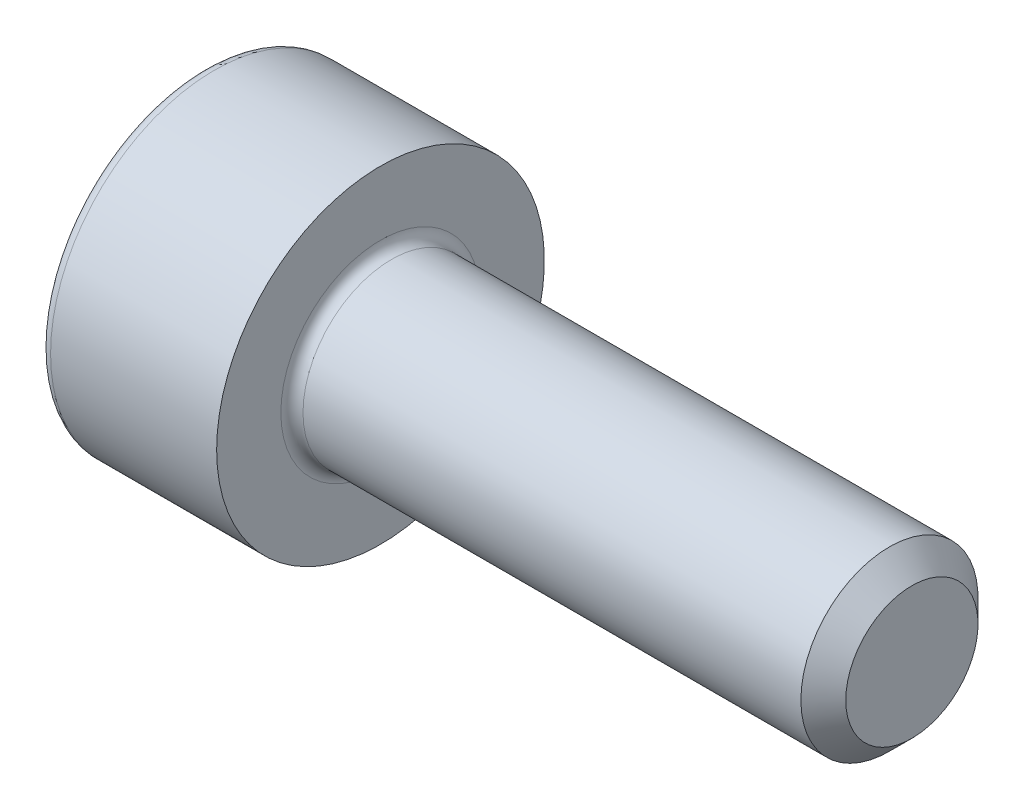
ISO-10303-21;
HEADER;
FILE_DESCRIPTION(('STEP AP214'),'2;1');
FILE_NAME('part.step','',(''),(''),'','','');
FILE_SCHEMA(('AUTOMOTIVE_DESIGN { 1 0 10303 214 1 1 1 1 }'));
ENDSEC;
DATA;
#1=APPLICATION_CONTEXT('core data for automotive mechanical design processes');
#2=APPLICATION_PROTOCOL_DEFINITION('international standard','automotive_design',2000,#1);
#3=PRODUCT_CONTEXT('',#1,'mechanical');
#4=PRODUCT('Part','Part','',(#3));
#5=PRODUCT_RELATED_PRODUCT_CATEGORY('part','',(#4));
#6=PRODUCT_DEFINITION_FORMATION('','',#4);
#7=PRODUCT_DEFINITION_CONTEXT('part definition',#1,'design');
#8=PRODUCT_DEFINITION('design','',#6,#7);
#9=PRODUCT_DEFINITION_SHAPE('','',#8);
#10=(LENGTH_UNIT() NAMED_UNIT(*) SI_UNIT(.MILLI.,.METRE.));
#11=(NAMED_UNIT(*) PLANE_ANGLE_UNIT() SI_UNIT($,.RADIAN.));
#12=(NAMED_UNIT(*) SI_UNIT($,.STERADIAN.) SOLID_ANGLE_UNIT());
#13=UNCERTAINTY_MEASURE_WITH_UNIT(LENGTH_MEASURE(1.E-05),#10,'distance_accuracy_value','');
#14=(GEOMETRIC_REPRESENTATION_CONTEXT(3) GLOBAL_UNCERTAINTY_ASSIGNED_CONTEXT((#13)) GLOBAL_UNIT_ASSIGNED_CONTEXT((#10,
#11,#12)) REPRESENTATION_CONTEXT('',''));
#15=CARTESIAN_POINT('',(0.,0.,0.));
#16=DIRECTION('',(0.,0.,1.));
#17=DIRECTION('',(1.,0.,0.));
#18=AXIS2_PLACEMENT_3D('',#15,#16,#17);
#19=CARTESIAN_POINT('',(6.,0.,0.));
#20=DIRECTION('',(-1.,0.,0.));
#21=DIRECTION('',(0.,0.,1.));
#22=AXIS2_PLACEMENT_3D('',#19,#20,#21);
#23=CONICAL_SURFACE('',#22,0.746499999993503,0.785398163397448);
#24=CARTESIAN_POINT('',(5.7464999999935,0.,0.));
#25=DIRECTION('',(-1.,0.,0.));
#26=DIRECTION('',(0.,0.,1.));
#27=AXIS2_PLACEMENT_3D('',#24,#25,#26);
#28=CIRCLE('',#27,1.);
#29=CARTESIAN_POINT('',(5.7464999999935,0.,1.));
#30=VERTEX_POINT('',#29);
#31=EDGE_CURVE('E11',#30,#30,#28,.T.);
#32=ORIENTED_EDGE('',*,*,#31,.F.);
#33=EDGE_LOOP('',(#32));
#34=FACE_BOUND('',#33,.T.);
#35=CARTESIAN_POINT('',(6.,0.,0.));
#36=DIRECTION('',(-1.,0.,0.));
#37=DIRECTION('',(0.,0.,1.));
#38=AXIS2_PLACEMENT_3D('',#35,#36,#37);
#39=CIRCLE('',#38,0.746499999993503);
#40=CARTESIAN_POINT('',(6.,0.,0.746499999993503));
#41=VERTEX_POINT('',#40);
#42=EDGE_CURVE('E133',#41,#41,#39,.T.);
#43=ORIENTED_EDGE('',*,*,#42,.T.);
#44=EDGE_LOOP('',(#43));
#45=FACE_BOUND('',#44,.T.);
#46=ADVANCED_FACE('F32',(#34,#45),#23,.T.);
#47=CARTESIAN_POINT('',(-2.,0.,0.));
#48=DIRECTION('',(-1.,0.,0.));
#49=DIRECTION('',(0.,0.,1.));
#50=AXIS2_PLACEMENT_3D('',#47,#48,#49);
#51=CYLINDRICAL_SURFACE('',#50,1.);
#52=CARTESIAN_POINT('',(0.125,0.,0.));
#53=DIRECTION('',(-1.,0.,0.));
#54=DIRECTION('',(0.,0.,1.));
#55=AXIS2_PLACEMENT_3D('',#52,#53,#54);
#56=CIRCLE('',#55,1.);
#57=CARTESIAN_POINT('',(0.125,0.,1.));
#58=VERTEX_POINT('',#57);
#59=EDGE_CURVE('E39',#58,#58,#56,.T.);
#60=ORIENTED_EDGE('',*,*,#59,.F.);
#61=EDGE_LOOP('',(#60));
#62=FACE_BOUND('',#61,.T.);
#63=ORIENTED_EDGE('',*,*,#31,.T.);
#64=EDGE_LOOP('',(#63));
#65=FACE_BOUND('',#64,.T.);
#66=ADVANCED_FACE('F157',(#62,#65),#51,.T.);
#67=CARTESIAN_POINT('',(0.125,0.,0.));
#68=DIRECTION('',(-1.,0.,0.));
#69=DIRECTION('',(0.,0.,1.));
#70=AXIS2_PLACEMENT_3D('',#67,#68,#69);
#71=TOROIDAL_SURFACE('',#70,1.125,0.125);
#72=CARTESIAN_POINT('',(0.,0.,0.));
#73=DIRECTION('',(-1.,0.,0.));
#74=DIRECTION('',(0.,0.,1.));
#75=AXIS2_PLACEMENT_3D('',#72,#73,#74);
#76=CIRCLE('',#75,1.125);
#77=CARTESIAN_POINT('',(0.,0.,1.125));
#78=VERTEX_POINT('',#77);
#79=EDGE_CURVE('E150',#78,#78,#76,.T.);
#80=ORIENTED_EDGE('',*,*,#79,.F.);
#81=EDGE_LOOP('',(#80));
#82=FACE_BOUND('',#81,.T.);
#83=ORIENTED_EDGE('',*,*,#59,.T.);
#84=EDGE_LOOP('',(#83));
#85=FACE_BOUND('',#84,.T.);
#86=ADVANCED_FACE('F155',(#82,#85),#71,.F.);
#87=CARTESIAN_POINT('',(0.,1.125,0.));
#88=DIRECTION('',(-1.,0.,0.));
#89=DIRECTION('',(0.,0.,1.));
#90=AXIS2_PLACEMENT_3D('',#87,#88,#89);
#91=PLANE('',#90);
#92=CARTESIAN_POINT('',(0.,0.,0.));
#93=DIRECTION('',(-1.,0.,0.));
#94=DIRECTION('',(0.,0.,1.));
#95=AXIS2_PLACEMENT_3D('',#92,#93,#94);
#96=CIRCLE('',#95,1.85);
#97=CARTESIAN_POINT('',(0.,0.,1.85));
#98=VERTEX_POINT('',#97);
#99=EDGE_CURVE('E147',#98,#98,#96,.T.);
#100=ORIENTED_EDGE('',*,*,#99,.F.);
#101=EDGE_LOOP('',(#100));
#102=FACE_BOUND('',#101,.T.);
#103=ORIENTED_EDGE('',*,*,#79,.T.);
#104=EDGE_LOOP('',(#103));
#105=FACE_BOUND('',#104,.T.);
#106=ADVANCED_FACE('F188',(#102,#105),#91,.F.);
#107=CARTESIAN_POINT('',(-2.,0.,0.));
#108=DIRECTION('',(-1.,0.,0.));
#109=DIRECTION('',(0.,0.,1.));
#110=AXIS2_PLACEMENT_3D('',#107,#108,#109);
#111=CYLINDRICAL_SURFACE('',#110,1.85);
#112=CARTESIAN_POINT('',(-1.875,0.,0.));
#113=DIRECTION('',(-1.,0.,0.));
#114=DIRECTION('',(0.,0.,1.));
#115=AXIS2_PLACEMENT_3D('',#112,#113,#114);
#116=CIRCLE('',#115,1.85);
#117=CARTESIAN_POINT('',(-1.875,0.,1.85));
#118=VERTEX_POINT('',#117);
#119=EDGE_CURVE('E144',#118,#118,#116,.T.);
#120=ORIENTED_EDGE('',*,*,#119,.F.);
#121=EDGE_LOOP('',(#120));
#122=FACE_BOUND('',#121,.T.);
#123=ORIENTED_EDGE('',*,*,#99,.T.);
#124=EDGE_LOOP('',(#123));
#125=FACE_BOUND('',#124,.T.);
#126=ADVANCED_FACE('F184',(#122,#125),#111,.T.);
#127=CARTESIAN_POINT('',(-1.875,0.,0.));
#128=DIRECTION('',(-1.,0.,0.));
#129=DIRECTION('',(0.,0.,1.));
#130=AXIS2_PLACEMENT_3D('',#127,#128,#129);
#131=TOROIDAL_SURFACE('',#130,1.725,0.125);
#132=CARTESIAN_POINT('',(-2.,0.,0.));
#133=DIRECTION('',(-1.,0.,0.));
#134=DIRECTION('',(0.,0.,1.));
#135=AXIS2_PLACEMENT_3D('',#132,#133,#134);
#136=CIRCLE('',#135,1.725);
#137=CARTESIAN_POINT('',(-2.,0.,1.725));
#138=VERTEX_POINT('',#137);
#139=EDGE_CURVE('E141',#138,#138,#136,.T.);
#140=ORIENTED_EDGE('',*,*,#139,.F.);
#141=EDGE_LOOP('',(#140));
#142=FACE_BOUND('',#141,.T.);
#143=ORIENTED_EDGE('',*,*,#119,.T.);
#144=EDGE_LOOP('',(#143));
#145=FACE_BOUND('',#144,.T.);
#146=ADVANCED_FACE('F177',(#142,#145),#131,.T.);
#147=CARTESIAN_POINT('',(-2.,1.725,0.));
#148=DIRECTION('',(1.,0.,0.));
#149=DIRECTION('',(0.,0.,-1.));
#150=AXIS2_PLACEMENT_3D('',#147,#148,#149);
#151=PLANE('',#150);
#152=DIRECTION('',(0.,0.5,-0.866025403784438));
#153=VECTOR('',#152,1.);
#154=CARTESIAN_POINT('',(-2.,0.433012701892219,0.75));
#155=LINE('',#154,#153);
#156=CARTESIAN_POINT('',(-2.,0.433012701892219,0.75));
#157=VERTEX_POINT('',#156);
#158=CARTESIAN_POINT('',(-2.,0.866025403784439,0.));
#159=VERTEX_POINT('',#158);
#160=EDGE_CURVE('E120',#157,#159,#155,.T.);
#161=ORIENTED_EDGE('',*,*,#160,.F.);
#162=DIRECTION('',(0.,1.,0.));
#163=VECTOR('',#162,1.);
#164=CARTESIAN_POINT('',(-2.,-0.43301270189222,0.75));
#165=LINE('',#164,#163);
#166=CARTESIAN_POINT('',(-2.,-0.43301270189222,0.75));
#167=VERTEX_POINT('',#166);
#168=EDGE_CURVE('E46',#167,#157,#165,.T.);
#169=ORIENTED_EDGE('',*,*,#168,.F.);
#170=DIRECTION('',(0.,0.5,0.866025403784439));
#171=VECTOR('',#170,1.);
#172=CARTESIAN_POINT('',(-2.,-0.866025403784439,0.));
#173=LINE('',#172,#171);
#174=CARTESIAN_POINT('',(-2.,-0.866025403784439,0.));
#175=VERTEX_POINT('',#174);
#176=EDGE_CURVE('E129',#175,#167,#173,.T.);
#177=ORIENTED_EDGE('',*,*,#176,.F.);
#178=DIRECTION('',(0.,-0.5,0.866025403784439));
#179=VECTOR('',#178,1.);
#180=CARTESIAN_POINT('',(-2.,-0.433012701892219,-0.75));
#181=LINE('',#180,#179);
#182=CARTESIAN_POINT('',(-2.,-0.433012701892219,-0.75));
#183=VERTEX_POINT('',#182);
#184=EDGE_CURVE('E127',#183,#175,#181,.T.);
#185=ORIENTED_EDGE('',*,*,#184,.F.);
#186=DIRECTION('',(0.,-1.,0.));
#187=VECTOR('',#186,1.);
#188=CARTESIAN_POINT('',(-2.,0.43301270189222,-0.75));
#189=LINE('',#188,#187);
#190=CARTESIAN_POINT('',(-2.,0.43301270189222,-0.75));
#191=VERTEX_POINT('',#190);
#192=EDGE_CURVE('E94',#191,#183,#189,.T.);
#193=ORIENTED_EDGE('',*,*,#192,.F.);
#194=DIRECTION('',(0.,-0.5,-0.866025403784439));
#195=VECTOR('',#194,1.);
#196=CARTESIAN_POINT('',(-2.,0.866025403784439,0.));
#197=LINE('',#196,#195);
#198=EDGE_CURVE('E123',#159,#191,#197,.T.);
#199=ORIENTED_EDGE('',*,*,#198,.F.);
#200=EDGE_LOOP('',(#161,#169,#177,#185,#193,#199));
#201=FACE_BOUND('',#200,.T.);
#202=ORIENTED_EDGE('',*,*,#139,.T.);
#203=EDGE_LOOP('',(#202));
#204=FACE_BOUND('',#203,.T.);
#205=ADVANCED_FACE('F169',(#201,#204),#151,.F.);
#206=CARTESIAN_POINT('',(6.,0.746499999993503,0.));
#207=DIRECTION('',(-1.,0.,0.));
#208=DIRECTION('',(0.,0.,1.));
#209=AXIS2_PLACEMENT_3D('',#206,#207,#208);
#210=PLANE('',#209);
#211=ORIENTED_EDGE('',*,*,#42,.F.);
#212=EDGE_LOOP('',(#211));
#213=FACE_BOUND('',#212,.T.);
#214=ADVANCED_FACE('F166',(#213),#210,.F.);
#215=CARTESIAN_POINT('',(-0.9,-0.43301270189222,0.75));
#216=DIRECTION('',(0.,0.,1.));
#217=DIRECTION('',(1.,0.,0.));
#218=AXIS2_PLACEMENT_3D('',#215,#216,#217);
#219=PLANE('',#218);
#220=ORIENTED_EDGE('',*,*,#168,.T.);
#221=DIRECTION('',(-1.,0.,0.));
#222=VECTOR('',#221,1.);
#223=CARTESIAN_POINT('',(-0.9,0.433012701892219,0.75));
#224=LINE('',#223,#222);
#225=CARTESIAN_POINT('',(-0.9,0.433012701892219,0.75));
#226=VERTEX_POINT('',#225);
#227=EDGE_CURVE('E76',#226,#157,#224,.T.);
#228=ORIENTED_EDGE('',*,*,#227,.F.);
#229=DIRECTION('',(0.,1.,0.));
#230=VECTOR('',#229,1.);
#231=CARTESIAN_POINT('',(-0.9,-0.43301270189222,0.75));
#232=LINE('',#231,#230);
#233=CARTESIAN_POINT('',(-0.9,-0.43301270189222,0.75));
#234=VERTEX_POINT('',#233);
#235=EDGE_CURVE('E131',#234,#226,#232,.T.);
#236=ORIENTED_EDGE('',*,*,#235,.F.);
#237=DIRECTION('',(-1.,0.,0.));
#238=VECTOR('',#237,1.);
#239=CARTESIAN_POINT('',(-0.9,-0.43301270189222,0.75));
#240=LINE('',#239,#238);
#241=EDGE_CURVE('E54',#234,#167,#240,.T.);
#242=ORIENTED_EDGE('',*,*,#241,.T.);
#243=EDGE_LOOP('',(#220,#228,#236,#242));
#244=FACE_BOUND('',#243,.T.);
#245=ADVANCED_FACE('F168',(#244),#219,.F.);
#246=CARTESIAN_POINT('',(-0.9,-0.866025403784439,0.));
#247=DIRECTION('',(0.,-0.866025403784439,0.5));
#248=DIRECTION('',(0.,-0.5,-0.866025403784439));
#249=AXIS2_PLACEMENT_3D('',#246,#247,#248);
#250=PLANE('',#249);
#251=ORIENTED_EDGE('',*,*,#176,.T.);
#252=ORIENTED_EDGE('',*,*,#241,.F.);
#253=DIRECTION('',(0.,0.5,0.866025403784439));
#254=VECTOR('',#253,1.);
#255=CARTESIAN_POINT('',(-0.9,-0.866025403784439,0.));
#256=LINE('',#255,#254);
#257=CARTESIAN_POINT('',(-0.9,-0.866025403784439,0.));
#258=VERTEX_POINT('',#257);
#259=EDGE_CURVE('E106',#258,#234,#256,.T.);
#260=ORIENTED_EDGE('',*,*,#259,.F.);
#261=DIRECTION('',(-1.,0.,0.));
#262=VECTOR('',#261,1.);
#263=CARTESIAN_POINT('',(-0.9,-0.866025403784439,0.));
#264=LINE('',#263,#262);
#265=EDGE_CURVE('E98',#258,#175,#264,.T.);
#266=ORIENTED_EDGE('',*,*,#265,.T.);
#267=EDGE_LOOP('',(#251,#252,#260,#266));
#268=FACE_BOUND('',#267,.T.);
#269=ADVANCED_FACE('F175',(#268),#250,.F.);
#270=CARTESIAN_POINT('',(-0.9,-0.433012701892219,-0.75));
#271=DIRECTION('',(0.,-0.866025403784439,-0.5));
#272=DIRECTION('',(0.,0.5,-0.866025403784439));
#273=AXIS2_PLACEMENT_3D('',#270,#271,#272);
#274=PLANE('',#273);
#275=ORIENTED_EDGE('',*,*,#184,.T.);
#276=ORIENTED_EDGE('',*,*,#265,.F.);
#277=DIRECTION('',(0.,-0.5,0.866025403784439));
#278=VECTOR('',#277,1.);
#279=CARTESIAN_POINT('',(-0.9,-0.433012701892219,-0.75));
#280=LINE('',#279,#278);
#281=CARTESIAN_POINT('',(-0.9,-0.433012701892219,-0.75));
#282=VERTEX_POINT('',#281);
#283=EDGE_CURVE('E102',#282,#258,#280,.T.);
#284=ORIENTED_EDGE('',*,*,#283,.F.);
#285=DIRECTION('',(-1.,0.,0.));
#286=VECTOR('',#285,1.);
#287=CARTESIAN_POINT('',(-0.9,-0.433012701892219,-0.75));
#288=LINE('',#287,#286);
#289=EDGE_CURVE('E87',#282,#183,#288,.T.);
#290=ORIENTED_EDGE('',*,*,#289,.T.);
#291=EDGE_LOOP('',(#275,#276,#284,#290));
#292=FACE_BOUND('',#291,.T.);
#293=ADVANCED_FACE('F103',(#292),#274,.F.);
#294=CARTESIAN_POINT('',(-0.9,0.43301270189222,-0.75));
#295=DIRECTION('',(0.,0.,-1.));
#296=DIRECTION('',(0.,1.,0.));
#297=AXIS2_PLACEMENT_3D('',#294,#295,#296);
#298=PLANE('',#297);
#299=ORIENTED_EDGE('',*,*,#192,.T.);
#300=ORIENTED_EDGE('',*,*,#289,.F.);
#301=DIRECTION('',(0.,-1.,0.));
#302=VECTOR('',#301,1.);
#303=CARTESIAN_POINT('',(-0.9,0.43301270189222,-0.75));
#304=LINE('',#303,#302);
#305=CARTESIAN_POINT('',(-0.9,0.43301270189222,-0.75));
#306=VERTEX_POINT('',#305);
#307=EDGE_CURVE('E91',#306,#282,#304,.T.);
#308=ORIENTED_EDGE('',*,*,#307,.F.);
#309=DIRECTION('',(-1.,0.,0.));
#310=VECTOR('',#309,1.);
#311=CARTESIAN_POINT('',(-0.9,0.43301270189222,-0.75));
#312=LINE('',#311,#310);
#313=EDGE_CURVE('E99',#306,#191,#312,.T.);
#314=ORIENTED_EDGE('',*,*,#313,.T.);
#315=EDGE_LOOP('',(#299,#300,#308,#314));
#316=FACE_BOUND('',#315,.T.);
#317=ADVANCED_FACE('F89',(#316),#298,.F.);
#318=CARTESIAN_POINT('',(-0.9,0.866025403784439,0.));
#319=DIRECTION('',(0.,0.866025403784439,-0.5));
#320=DIRECTION('',(0.,0.5,0.866025403784439));
#321=AXIS2_PLACEMENT_3D('',#318,#319,#320);
#322=PLANE('',#321);
#323=ORIENTED_EDGE('',*,*,#198,.T.);
#324=ORIENTED_EDGE('',*,*,#313,.F.);
#325=DIRECTION('',(0.,-0.5,-0.866025403784439));
#326=VECTOR('',#325,1.);
#327=CARTESIAN_POINT('',(-0.9,0.866025403784439,0.));
#328=LINE('',#327,#326);
#329=CARTESIAN_POINT('',(-0.9,0.866025403784439,0.));
#330=VERTEX_POINT('',#329);
#331=EDGE_CURVE('E112',#330,#306,#328,.T.);
#332=ORIENTED_EDGE('',*,*,#331,.F.);
#333=DIRECTION('',(-1.,0.,0.));
#334=VECTOR('',#333,1.);
#335=CARTESIAN_POINT('',(-0.9,0.866025403784439,0.));
#336=LINE('',#335,#334);
#337=EDGE_CURVE('E136',#330,#159,#336,.T.);
#338=ORIENTED_EDGE('',*,*,#337,.T.);
#339=EDGE_LOOP('',(#323,#324,#332,#338));
#340=FACE_BOUND('',#339,.T.);
#341=ADVANCED_FACE('F250',(#340),#322,.F.);
#342=CARTESIAN_POINT('',(-0.9,0.433012701892219,0.75));
#343=DIRECTION('',(0.,0.866025403784439,0.5));
#344=DIRECTION('',(0.,-0.5,0.866025403784438));
#345=AXIS2_PLACEMENT_3D('',#342,#343,#344);
#346=PLANE('',#345);
#347=ORIENTED_EDGE('',*,*,#160,.T.);
#348=ORIENTED_EDGE('',*,*,#337,.F.);
#349=DIRECTION('',(0.,0.5,-0.866025403784438));
#350=VECTOR('',#349,1.);
#351=CARTESIAN_POINT('',(-0.9,0.433012701892219,0.75));
#352=LINE('',#351,#350);
#353=EDGE_CURVE('E114',#226,#330,#352,.T.);
#354=ORIENTED_EDGE('',*,*,#353,.F.);
#355=ORIENTED_EDGE('',*,*,#227,.T.);
#356=EDGE_LOOP('',(#347,#348,#354,#355));
#357=FACE_BOUND('',#356,.T.);
#358=ADVANCED_FACE('F259',(#357),#346,.F.);
#359=CARTESIAN_POINT('',(-0.9,0.,0.));
#360=DIRECTION('',(-1.,0.,0.));
#361=DIRECTION('',(0.,0.,1.));
#362=AXIS2_PLACEMENT_3D('',#359,#360,#361);
#363=PLANE('',#362);
#364=ORIENTED_EDGE('',*,*,#235,.T.);
#365=ORIENTED_EDGE('',*,*,#353,.T.);
#366=ORIENTED_EDGE('',*,*,#331,.T.);
#367=ORIENTED_EDGE('',*,*,#307,.T.);
#368=ORIENTED_EDGE('',*,*,#283,.T.);
#369=ORIENTED_EDGE('',*,*,#259,.T.);
#370=EDGE_LOOP('',(#364,#365,#366,#367,#368,#369));
#371=FACE_BOUND('',#370,.T.);
#372=ADVANCED_FACE('F109',(#371),#363,.T.);
#373=CLOSED_SHELL('',(#46,#66,#86,#106,#126,#146,#205,#214,#245,#269,#293,#317,#341,#358,#372));
#374=MANIFOLD_SOLID_BREP('B2',#373);
#375=ADVANCED_BREP_SHAPE_REPRESENTATION('',(#18,#374),#14);
#376=SHAPE_DEFINITION_REPRESENTATION(#9,#375);
ENDSEC;
END-ISO-10303-21;
